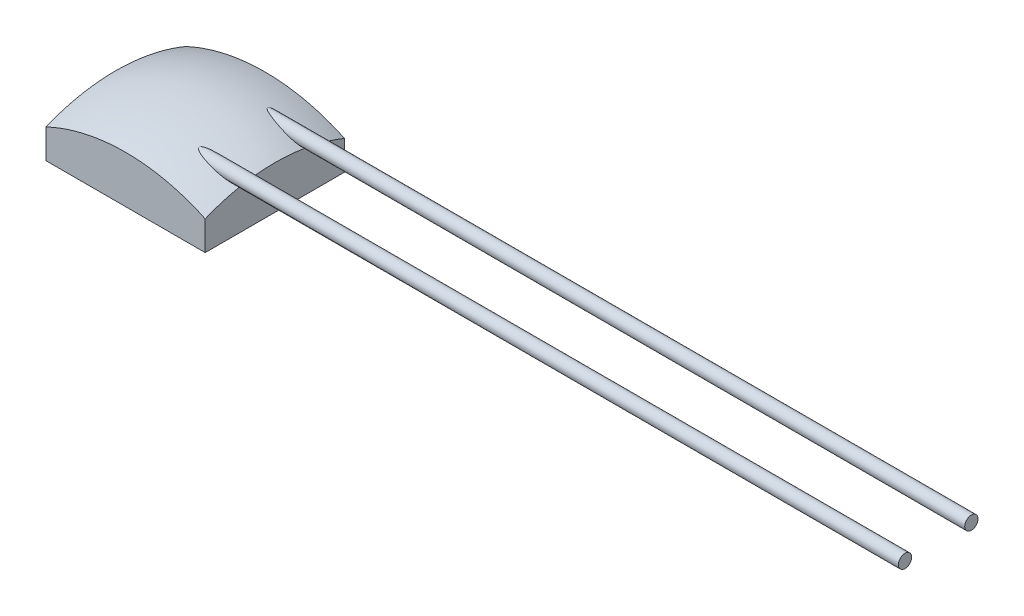
ISO-10303-21;
HEADER;
FILE_DESCRIPTION(('STEP AP214'),'2;1');
FILE_NAME('part.step','',(''),(''),'','','');
FILE_SCHEMA(('AUTOMOTIVE_DESIGN { 1 0 10303 214 1 1 1 1 }'));
ENDSEC;
DATA;
#1=APPLICATION_CONTEXT('core data for automotive mechanical design processes');
#2=APPLICATION_PROTOCOL_DEFINITION('international standard','automotive_design',2000,#1);
#3=PRODUCT_CONTEXT('',#1,'mechanical');
#4=PRODUCT('Part','Part','',(#3));
#5=PRODUCT_RELATED_PRODUCT_CATEGORY('part','',(#4));
#6=PRODUCT_DEFINITION_FORMATION('','',#4);
#7=PRODUCT_DEFINITION_CONTEXT('part definition',#1,'design');
#8=PRODUCT_DEFINITION('design','',#6,#7);
#9=PRODUCT_DEFINITION_SHAPE('','',#8);
#10=(LENGTH_UNIT() NAMED_UNIT(*) SI_UNIT(.MILLI.,.METRE.));
#11=(NAMED_UNIT(*) PLANE_ANGLE_UNIT() SI_UNIT($,.RADIAN.));
#12=(NAMED_UNIT(*) SI_UNIT($,.STERADIAN.) SOLID_ANGLE_UNIT());
#13=UNCERTAINTY_MEASURE_WITH_UNIT(LENGTH_MEASURE(1.E-05),#10,'distance_accuracy_value','');
#14=(GEOMETRIC_REPRESENTATION_CONTEXT(3) GLOBAL_UNCERTAINTY_ASSIGNED_CONTEXT((#13)) GLOBAL_UNIT_ASSIGNED_CONTEXT((#10,
#11,#12)) REPRESENTATION_CONTEXT('',''));
#15=CARTESIAN_POINT('',(0.,0.,0.));
#16=DIRECTION('',(0.,0.,1.));
#17=DIRECTION('',(1.,0.,0.));
#18=AXIS2_PLACEMENT_3D('',#15,#16,#17);
#19=CARTESIAN_POINT('',(0.,-2.1,0.));
#20=DIRECTION('',(0.,-1.,0.));
#21=DIRECTION('',(1.,0.,0.));
#22=AXIS2_PLACEMENT_3D('',#19,#20,#21);
#23=SPHERICAL_SURFACE('',#22,3.);
#24=CARTESIAN_POINT('',(0.576240865673341,0.799279968676473,-0.511978640139787));
#25=CARTESIAN_POINT('',(0.576698440532516,0.799476045551816,-0.51035326129361));
#26=CARTESIAN_POINT('',(0.577340743051578,0.79962578146369,-0.508773889246992));
#27=CARTESIAN_POINT('',(0.578891476645949,0.799846563634191,-0.505744505300956));
#28=CARTESIAN_POINT('',(0.579801176854642,0.799917226724269,-0.504295154342088));
#29=CARTESIAN_POINT('',(0.582428272725836,0.800023685064696,-0.500647271377808));
#30=CARTESIAN_POINT('',(0.584292470417058,0.800009108669073,-0.498555127833212));
#31=CARTESIAN_POINT('',(0.588273628419364,0.799875026727414,-0.494638086313737));
#32=CARTESIAN_POINT('',(0.590391150843662,0.799755283948023,-0.492813803442786));
#33=CARTESIAN_POINT('',(0.599684406913788,0.799102143178642,-0.485456063949785));
#34=CARTESIAN_POINT('',(0.607519733058122,0.798244258707961,-0.480813833260897));
#35=CARTESIAN_POINT('',(0.623602737001412,0.796209574871628,-0.472413447747457));
#36=CARTESIAN_POINT('',(0.631852847862261,0.795030655212648,-0.468661492605417));
#37=CARTESIAN_POINT('',(0.657710345667869,0.791042005778335,-0.457885318011154));
#38=CARTESIAN_POINT('',(0.675652452145567,0.787862213510135,-0.451787669890338));
#39=CARTESIAN_POINT('',(0.711797890256333,0.780865198779468,-0.440829605466151));
#40=CARTESIAN_POINT('',(0.730001797096632,0.777046275803305,-0.4359725795323));
#41=CARTESIAN_POINT('',(0.766597514572408,0.768831436602,-0.427207480169605));
#42=CARTESIAN_POINT('',(0.78498979276462,0.764433172443225,-0.423303463359898));
#43=CARTESIAN_POINT('',(0.821771698668982,0.755119233923595,-0.416361815379837));
#44=CARTESIAN_POINT('',(0.840161287661465,0.750204358723886,-0.413322872240811));
#45=CARTESIAN_POINT('',(0.88139975731868,0.738604630319943,-0.407470493043484));
#46=CARTESIAN_POINT('',(0.90424390202261,0.731780231076851,-0.40489223465871));
#47=CARTESIAN_POINT('',(0.949797793351985,0.717351207061645,-0.401236411176971));
#48=CARTESIAN_POINT('',(0.972507585454441,0.709746864416666,-0.400158305474454));
#49=CARTESIAN_POINT('',(1.01750789343149,0.693804505924328,-0.39987324490482));
#50=CARTESIAN_POINT('',(1.03980029827966,0.68547267908922,-0.400651752575037));
#51=CARTESIAN_POINT('',(1.07278449445769,0.672406048192698,-0.40378050197204));
#52=CARTESIAN_POINT('',(1.0836854938973,0.667963655190643,-0.405146305200815));
#53=CARTESIAN_POINT('',(1.10526802137715,0.658890931417101,-0.40870926552093));
#54=CARTESIAN_POINT('',(1.11594976137856,0.654260796406546,-0.410905575570886));
#55=CARTESIAN_POINT('',(1.13538066884751,0.645532880344801,-0.416006661227098));
#56=CARTESIAN_POINT('',(1.14418052806651,0.641458650929756,-0.418756988575102));
#57=CARTESIAN_POINT('',(1.16129670660003,0.633231265520665,-0.425366845174073));
#58=CARTESIAN_POINT('',(1.16961521035036,0.629078602008889,-0.429220797753165));
#59=CARTESIAN_POINT('',(1.1804655494535,0.623354276289152,-0.43572649310771));
#60=CARTESIAN_POINT('',(1.18341342752961,0.621763945131125,-0.437662727476359));
#61=CARTESIAN_POINT('',(1.18910653436953,0.618604714867435,-0.44184729161193));
#62=CARTESIAN_POINT('',(1.19185135866388,0.617035863355646,-0.444096219891286));
#63=CARTESIAN_POINT('',(1.1970648846046,0.613937481067819,-0.448992643127698));
#64=CARTESIAN_POINT('',(1.19952996935212,0.612408627456558,-0.451644504152009));
#65=CARTESIAN_POINT('',(1.20397314101834,0.60947573751877,-0.457389451381199));
#66=CARTESIAN_POINT('',(1.2059530735037,0.608071241577013,-0.460480792494528));
#67=CARTESIAN_POINT('',(1.208552115273,0.605996265022646,-0.465823697844601));
#68=CARTESIAN_POINT('',(1.20940099442364,0.605252752186916,-0.467934281357122));
#69=CARTESIAN_POINT('',(1.2107596461677,0.603886125928035,-0.472299238089109));
#70=CARTESIAN_POINT('',(1.21126980122574,0.603262877276843,-0.474553445973405));
#71=CARTESIAN_POINT('',(1.21190248785893,0.602165217511361,-0.47916725197804));
#72=CARTESIAN_POINT('',(1.21202262642784,0.601691741278888,-0.481527410981106));
#73=CARTESIAN_POINT('',(1.21185437546716,0.600919125480308,-0.486261875273666));
#74=CARTESIAN_POINT('',(1.21156588785666,0.600620027793911,-0.488636183823192));
#75=CARTESIAN_POINT('',(1.21064734872417,0.600210686589513,-0.493153335424051));
#76=CARTESIAN_POINT('',(1.21004326478269,0.600088442003945,-0.495300570096161));
#77=CARTESIAN_POINT('',(1.20856001756832,0.599979155486512,-0.499499965258608));
#78=CARTESIAN_POINT('',(1.20768073470813,0.599992172411685,-0.501552083970498));
#79=CARTESIAN_POINT('',(1.20506653911228,0.600178854470726,-0.506815646092357));
#80=CARTESIAN_POINT('',(1.20314390402794,0.600449856300566,-0.509929999464067));
#81=CARTESIAN_POINT('',(1.19889484490478,0.601217227484595,-0.515839255839478));
#82=CARTESIAN_POINT('',(1.19656713773197,0.601714321351088,-0.518633095433995));
#83=CARTESIAN_POINT('',(1.1896080376026,0.603344548818494,-0.526123195879892));
#84=CARTESIAN_POINT('',(1.18466267799143,0.604663807212367,-0.530483386708567));
#85=CARTESIAN_POINT('',(1.174304762979,0.607600192242984,-0.538474523675965));
#86=CARTESIAN_POINT('',(1.16889099839719,0.60921810281884,-0.542103496730261));
#87=CARTESIAN_POINT('',(1.15558183980314,0.613313974107379,-0.55013223116531));
#88=CARTESIAN_POINT('',(1.14755429945624,0.615878423597452,-0.554266266124833));
#89=CARTESIAN_POINT('',(1.13119352881307,0.621201797027503,-0.561738667034829));
#90=CARTESIAN_POINT('',(1.12285972286917,0.623961097220112,-0.565075435859581));
#91=CARTESIAN_POINT('',(1.09751041307879,0.632423863559681,-0.5741825710018));
#92=CARTESIAN_POINT('',(1.08021482644777,0.638290330542896,-0.579013841316598));
#93=CARTESIAN_POINT('',(1.03953640220033,0.652076578198062,-0.588275772690635));
#94=CARTESIAN_POINT('',(1.01602768127254,0.660035292060854,-0.592048498085154));
#95=CARTESIAN_POINT('',(0.968697489082186,0.675855160315568,-0.597397969818157));
#96=CARTESIAN_POINT('',(0.944875509093151,0.683716100975287,-0.598970536434315));
#97=CARTESIAN_POINT('',(0.897157523946612,0.699175020614801,-0.600296336473199));
#98=CARTESIAN_POINT('',(0.87326178304995,0.706773522086761,-0.600053422527118));
#99=CARTESIAN_POINT('',(0.825447558923165,0.721659457940977,-0.597915175086452));
#100=CARTESIAN_POINT('',(0.801529073751808,0.728946862765569,-0.596019684943531));
#101=CARTESIAN_POINT('',(0.754475476681414,0.742983078258327,-0.590597835185693));
#102=CARTESIAN_POINT('',(0.731337832413607,0.74974139273054,-0.58712056581184));
#103=CARTESIAN_POINT('',(0.692755226672634,0.76085666665064,-0.579536772768961));
#104=CARTESIAN_POINT('',(0.677223090550502,0.765288604943006,-0.575989761644213));
#105=CARTESIAN_POINT('',(0.651307852816891,0.772698707504365,-0.568795952535851));
#106=CARTESIAN_POINT('',(0.640833901473795,0.775697961601157,-0.565527443620137));
#107=CARTESIAN_POINT('',(0.623417572491995,0.78077870703001,-0.559041785623963));
#108=CARTESIAN_POINT('',(0.616366050996216,0.782863139293648,-0.556108686848767));
#109=CARTESIAN_POINT('',(0.60223743697839,0.787173320702457,-0.549189864395355));
#110=CARTESIAN_POINT('',(0.595179536154272,0.789400621582098,-0.545155841595693));
#111=CARTESIAN_POINT('',(0.587529957550349,0.79212360102504,-0.538918582120713));
#112=CARTESIAN_POINT('',(0.586158272880458,0.792626529721846,-0.537711666687716));
#113=CARTESIAN_POINT('',(0.583551123865027,0.793627998473187,-0.535152938988275));
#114=CARTESIAN_POINT('',(0.582315703942393,0.79412653704807,-0.533801079751097));
#115=CARTESIAN_POINT('',(0.580233070359693,0.795031145407197,-0.531156086209905));
#116=CARTESIAN_POINT('',(0.579355369221606,0.79543925949563,-0.529888097209732));
#117=CARTESIAN_POINT('',(0.577815175636398,0.796233812460191,-0.527220864903687));
#118=CARTESIAN_POINT('',(0.57715212036088,0.796620305788149,-0.525821977467186));
#119=CARTESIAN_POINT('',(0.576260608324526,0.797255223613249,-0.523294604716208));
#120=CARTESIAN_POINT('',(0.575963491864414,0.797513050994201,-0.522193008542625));
#121=CARTESIAN_POINT('',(0.575560261655642,0.7979967479926,-0.519948639717626));
#122=CARTESIAN_POINT('',(0.575453915620594,0.798222656166248,-0.518805918873196));
#123=CARTESIAN_POINT('',(0.575445117592252,0.798599634134411,-0.51670496352834));
#124=CARTESIAN_POINT('',(0.575511525456848,0.798756901356881,-0.515747854544333));
#125=CARTESIAN_POINT('',(0.575778850940734,0.799041133813636,-0.51384838310943));
#126=CARTESIAN_POINT('',(0.575979789868596,0.799168094243262,-0.512906023018835));
#127=CARTESIAN_POINT('',(0.576240865673341,0.799279968676473,-0.511978640139787));
#128=B_SPLINE_CURVE_WITH_KNOTS('',3,(#24,#25,#26,#27,#28,#29,#30,#31,#32,#33,#34,#35,#36,#37,
#38,#39,#40,#41,#42,#43,#44,#45,#46,#47,#48,#49,#50,#51,#52,#53,#54,#55,#56,#57,#58,#59,#60,#61,
#62,#63,#64,#65,#66,#67,#68,#69,#70,#71,#72,#73,#74,#75,#76,#77,#78,#79,#80,#81,#82,#83,#84,#85,
#86,#87,#88,#89,#90,#91,#92,#93,#94,#95,#96,#97,#98,#99,#100,#101,#102,#103,#104,#105,#106,#107,
#108,#109,#110,#111,#112,#113,#114,#115,#116,#117,#118,#119,#120,#121,#122,#123,#124,#125,#126,
#127),.UNSPECIFIED.,.T.,.F.,(4,2,2,2,2,2,2,2,2,2,2,2,2,2,2,2,2,2,2,2,2,2,2,2,2,2,2,2,2,2,2,2,2,
2,2,2,2,2,2,2,2,2,2,2,2,2,2,2,2,2,2,4),(0.,0.00509471985115773,0.0102140220451698,
0.0185732816974082,0.0269514466627636,0.0541831537999721,0.0815992691155205,0.139096990725946,
0.196750200254489,0.254644699292778,0.312450922103352,0.384335702786485,0.456194571850682,
0.527492628693761,0.563022059747608,0.598515351327128,0.628716845851685,0.658768345166241,
0.67036192196478,0.681978003037514,0.693730351379271,0.705437273277011,0.7125911817269,
0.719736998661652,0.726926577803773,0.734117882924194,0.740793677291624,0.747472376653427,
0.758418652423879,0.769400255418687,0.789457923115105,0.809569009317905,0.837662010228026,
0.865810825342058,0.922345388720209,0.997530202736491,1.0728576550496,1.14802530043972,
1.22320007177474,1.29618609936994,1.34576349706187,1.37983260264031,1.40358700488281,
1.42862447712984,1.4343018852723,1.43998113883808,1.44475271965728,1.44951168549554,
1.45300641105738,1.45649687846647,1.45940328244426,1.46231014688058),.UNSPECIFIED.);
#129=CARTESIAN_POINT('',(1.2,0.601023317731769,-0.514269420702096));
#130=VERTEX_POINT('',#129);
#131=CARTESIAN_POINT('',(1.2,0.612079278065512,-0.452356042833133));
#132=VERTEX_POINT('',#131);
#133=EDGE_CURVE('E98',#130,#132,#128,.T.);
#134=ORIENTED_EDGE('',*,*,#133,.F.);
#135=CARTESIAN_POINT('',(1.2,-2.1,0.));
#136=DIRECTION('',(1.,0.,0.));
#137=DIRECTION('',(0.,0.,-1.));
#138=AXIS2_PLACEMENT_3D('',#135,#136,#137);
#139=CIRCLE('',#138,2.7495454169735);
#140=CARTESIAN_POINT('',(1.2,0.441161151914612,-1.05));
#141=VERTEX_POINT('',#140);
#142=EDGE_CURVE('E86',#130,#141,#139,.F.);
#143=ORIENTED_EDGE('',*,*,#142,.T.);
#144=CARTESIAN_POINT('',(0.,-2.1,-1.05));
#145=DIRECTION('',(0.,0.,-1.));
#146=DIRECTION('',(-1.,0.,0.));
#147=AXIS2_PLACEMENT_3D('',#144,#145,#146);
#148=CIRCLE('',#147,2.81024909927928);
#149=CARTESIAN_POINT('',(-1.2,0.441161151914612,-1.05));
#150=VERTEX_POINT('',#149);
#151=EDGE_CURVE('E95',#141,#150,#148,.F.);
#152=ORIENTED_EDGE('',*,*,#151,.T.);
#153=CARTESIAN_POINT('',(-1.2,-2.1,0.));
#154=DIRECTION('',(-1.,0.,0.));
#155=DIRECTION('',(0.,0.,1.));
#156=AXIS2_PLACEMENT_3D('',#153,#154,#155);
#157=CIRCLE('',#156,2.7495454169735);
#158=CARTESIAN_POINT('',(-1.2,0.441161151914612,1.05));
#159=VERTEX_POINT('',#158);
#160=EDGE_CURVE('E181',#150,#159,#157,.F.);
#161=ORIENTED_EDGE('',*,*,#160,.T.);
#162=CARTESIAN_POINT('',(0.,-2.1,1.05));
#163=DIRECTION('',(0.,0.,1.));
#164=DIRECTION('',(1.,0.,0.));
#165=AXIS2_PLACEMENT_3D('',#162,#163,#164);
#166=CIRCLE('',#165,2.81024909927928);
#167=CARTESIAN_POINT('',(1.2,0.441161151914612,1.05));
#168=VERTEX_POINT('',#167);
#169=EDGE_CURVE('E172',#159,#168,#166,.F.);
#170=ORIENTED_EDGE('',*,*,#169,.T.);
#171=CARTESIAN_POINT('',(1.2,0.601023317731768,0.514269420702096));
#172=VERTEX_POINT('',#171);
#173=EDGE_CURVE('E191',#168,#172,#139,.F.);
#174=ORIENTED_EDGE('',*,*,#173,.T.);
#175=CARTESIAN_POINT('',(1.2002,0.611951222332437,0.452593114938355));
#176=CARTESIAN_POINT('',(1.19591582693882,0.614681281546974,0.447594619139513));
#177=CARTESIAN_POINT('',(1.19107973116606,0.617514171643169,0.443278358546464));
#178=CARTESIAN_POINT('',(1.18077133359095,0.623225243986398,0.435742208305545));
#179=CARTESIAN_POINT('',(1.17531104019783,0.626101873642248,0.43250517123114));
#180=CARTESIAN_POINT('',(1.15648407794038,0.635696050513195,0.422820835792717));
#181=CARTESIAN_POINT('',(1.14235868713552,0.642377147232193,0.417909627456812));
#182=CARTESIAN_POINT('',(1.11322984910015,0.655502011689797,0.410127352517914));
#183=CARTESIAN_POINT('',(1.09821533040531,0.661939541389821,0.40729367394247));
#184=CARTESIAN_POINT('',(1.06230255804365,0.676716146529162,0.402330539785429));
#185=CARTESIAN_POINT('',(1.04125224281241,0.684894297359709,0.400833011865198));
#186=CARTESIAN_POINT('',(0.99883346914428,0.70055121254838,0.399697280239385));
#187=CARTESIAN_POINT('',(0.977464529731629,0.708028761459538,0.400062249032603));
#188=CARTESIAN_POINT('',(0.934683739352722,0.722246202385566,0.402242459650218));
#189=CARTESIAN_POINT('',(0.913272698149582,0.728989749875082,0.404050102017371));
#190=CARTESIAN_POINT('',(0.87039249582961,0.741783206938719,0.408890579020935));
#191=CARTESIAN_POINT('',(0.84892335489941,0.747833331972211,0.41192303175362));
#192=CARTESIAN_POINT('',(0.80495044450103,0.759507022288469,0.419322265428411));
#193=CARTESIAN_POINT('',(0.782447135197758,0.765095533977506,0.423746765618688));
#194=CARTESIAN_POINT('',(0.73756731368784,0.775452251338203,0.433963675367724));
#195=CARTESIAN_POINT('',(0.715190718193325,0.780221076513134,0.439755043947399));
#196=CARTESIAN_POINT('',(0.681915092873955,0.786643215895529,0.449913468950106));
#197=CARTESIAN_POINT('',(0.670864552248557,0.788663121917631,0.45354759600655));
#198=CARTESIAN_POINT('',(0.648986326171087,0.792398866729101,0.461502098236827));
#199=CARTESIAN_POINT('',(0.638158144740964,0.794115466967798,0.465820701736728));
#200=CARTESIAN_POINT('',(0.620064087606322,0.796677944151662,0.474179654191741));
#201=CARTESIAN_POINT('',(0.612687360519846,0.797631411852361,0.477928106645923));
#202=CARTESIAN_POINT('',(0.601878093364666,0.798807115742772,0.484436983594046));
#203=CARTESIAN_POINT('',(0.598235854442311,0.799161594009754,0.48682146739409));
#204=CARTESIAN_POINT('',(0.59125908403352,0.799715687647671,0.49201665285894));
#205=CARTESIAN_POINT('',(0.587922920508097,0.79991617220498,0.494824853667324));
#206=CARTESIAN_POINT('',(0.583882071510973,0.80000158516025,0.499074010723441));
#207=CARTESIAN_POINT('',(0.582874345206506,0.800006851937351,0.500220037480568));
#208=CARTESIAN_POINT('',(0.580981152662644,0.799973089204631,0.502612482146851));
#209=CARTESIAN_POINT('',(0.580095828344914,0.799934008750718,0.503859013982263));
#210=CARTESIAN_POINT('',(0.578490016728427,0.799798725394533,0.506477094699964));
#211=CARTESIAN_POINT('',(0.577771880803778,0.79970176895127,0.507850086997858));
#212=CARTESIAN_POINT('',(0.57659354822237,0.799436493502476,0.510695871372723));
#213=CARTESIAN_POINT('',(0.57613247524848,0.799268420420962,0.512168304968555));
#214=CARTESIAN_POINT('',(0.575617115923675,0.798908397429385,0.514777957817619));
#215=CARTESIAN_POINT('',(0.575488242384795,0.798734011373147,0.515902818962532));
#216=CARTESIAN_POINT('',(0.575425184015901,0.79834546353903,0.518151264047677));
#217=CARTESIAN_POINT('',(0.575490957237741,0.798131310340654,0.519274848210903));
#218=CARTESIAN_POINT('',(0.57580893609136,0.797671486437685,0.521483767649792));
#219=CARTESIAN_POINT('',(0.576060506746925,0.797425925429218,0.522569220039655));
#220=CARTESIAN_POINT('',(0.576723721983538,0.7969117814721,0.524683882309739));
#221=CARTESIAN_POINT('',(0.577135505995732,0.796643178629663,0.525713042307303));
#222=CARTESIAN_POINT('',(0.578381648037879,0.795920387684795,0.528321077805155));
#223=CARTESIAN_POINT('',(0.57931987784968,0.795454108611809,0.529846543330691));
#224=CARTESIAN_POINT('',(0.581418397068878,0.794504246670102,0.532729995751978));
#225=CARTESIAN_POINT('',(0.582579413389276,0.794020611491196,0.534087409790656));
#226=CARTESIAN_POINT('',(0.5868598550676,0.792328560563707,0.538564643352374));
#227=CARTESIAN_POINT('',(0.590339207408978,0.791104637461792,0.541326523168721));
#228=CARTESIAN_POINT('',(0.597648612216824,0.788659503706457,0.546336759331222));
#229=CARTESIAN_POINT('',(0.601480771466175,0.787438360834072,0.548581707363833));
#230=CARTESIAN_POINT('',(0.612398161878051,0.784045955988772,0.554359601695429));
#231=CARTESIAN_POINT('',(0.619679345724801,0.78188003198209,0.557523281165877));
#232=CARTESIAN_POINT('',(0.634480981422526,0.777544520337372,0.563240164767758));
#233=CARTESIAN_POINT('',(0.642002026893475,0.775374938624311,0.565791695429973));
#234=CARTESIAN_POINT('',(0.66478868881969,0.768831903779407,0.572827582439743));
#235=CARTESIAN_POINT('',(0.680242087929022,0.764434618747971,0.576677723168173));
#236=CARTESIAN_POINT('',(0.722556015493366,0.752296300568486,0.585771407332125));
#237=CARTESIAN_POINT('',(0.749586076878414,0.744436293341578,0.590009845844015));
#238=CARTESIAN_POINT('',(0.803818556504477,0.728269119806225,0.596306867643608));
#239=CARTESIAN_POINT('',(0.831021222566619,0.719961011928319,0.5983606567819));
#240=CARTESIAN_POINT('',(0.885225441149411,0.702998072084011,0.600317178626691));
#241=CARTESIAN_POINT('',(0.912227251578661,0.69434550492283,0.600232194948558));
#242=CARTESIAN_POINT('',(0.965993893549538,0.676768716777772,0.59767083670798));
#243=CARTESIAN_POINT('',(0.992759086211614,0.667845062342488,0.59519915638676));
#244=CARTESIAN_POINT('',(1.0338453007167,0.654003944069739,0.588954641714437));
#245=CARTESIAN_POINT('',(1.04833493225246,0.649094645607504,0.586271262748397));
#246=CARTESIAN_POINT('',(1.0771534910634,0.639327878413646,0.579712082653121));
#247=CARTESIAN_POINT('',(1.0914813442902,0.634470761286769,0.575830741675081));
#248=CARTESIAN_POINT('',(1.1176441894496,0.625689182325612,0.567157796288467));
#249=CARTESIAN_POINT('',(1.12953850933134,0.621731862488429,0.562580876095718));
#250=CARTESIAN_POINT('',(1.15261940025835,0.614240417648816,0.551852023321529));
#251=CARTESIAN_POINT('',(1.16381264727462,0.610701864859286,0.545719237217129));
#252=CARTESIAN_POINT('',(1.17905910443346,0.60623234847568,0.534941319846124));
#253=CARTESIAN_POINT('',(1.18368463372192,0.604929887700076,0.53130117446594));
#254=CARTESIAN_POINT('',(1.19242247800014,0.602657816552046,0.523265192939721));
#255=CARTESIAN_POINT('',(1.19652732609991,0.60169276110126,0.518860134029706));
#256=CARTESIAN_POINT('',(1.20020000000007,0.60098522859458,0.51400267987018));
#257=B_SPLINE_CURVE_WITH_KNOTS('',3,(#175,#176,#177,#178,#179,#180,#181,#182,#183,#184,#185,
#186,#187,#188,#189,#190,#191,#192,#193,#194,#195,#196,#197,#198,#199,#200,#201,#202,#203,#204,
#205,#206,#207,#208,#209,#210,#211,#212,#213,#214,#215,#216,#217,#218,#219,#220,#221,#222,#223,
#224,#225,#226,#227,#228,#229,#230,#231,#232,#233,#234,#235,#236,#237,#238,#239,#240,#241,#242,
#243,#244,#245,#246,#247,#248,#249,#250,#251,#252,#253,#254,#255,#256),.UNSPECIFIED.,.F.,.F.,(4,
2,2,2,2,2,2,2,2,2,2,2,2,2,2,2,2,2,2,2,2,2,2,2,2,2,2,2,2,2,2,2,2,2,2,2,2,2,2,2,4),(0.,
0.0211725270541012,0.0419905434310988,0.0908012560628805,0.140470160185068,0.208221047714887,
0.276087377745721,0.343598554680875,0.411088697428723,0.481861031577078,0.552579639896058,
0.587983622539557,0.623297419954564,0.648222395467823,0.661312761530353,0.67432868740153,
0.678900397018955,0.683477363730767,0.688115263298263,0.692737254242634,0.696157771045187,
0.69957755074896,0.702985696875999,0.706396815717198,0.711916351880569,0.717454213330773,
0.731170940490474,0.744975670524122,0.769598276996059,0.794287447784537,0.843786111242905,
0.929071773152212,1.01454420827514,1.09952586212503,1.18434071072325,1.23090664105149,
1.27769122142338,1.31766699568078,1.35717286023636,1.37519242746529,1.39344662988426),.UNSPECIFIED.);
#258=CARTESIAN_POINT('',(1.2,0.612079278065512,0.452356042833133));
#259=VERTEX_POINT('',#258);
#260=EDGE_CURVE('E150',#259,#172,#257,.T.);
#261=ORIENTED_EDGE('',*,*,#260,.F.);
#262=EDGE_CURVE('E94',#259,#132,#139,.F.);
#263=ORIENTED_EDGE('',*,*,#262,.T.);
#264=EDGE_LOOP('',(#134,#143,#152,#161,#170,#174,#261,#263));
#265=FACE_BOUND('',#264,.T.);
#266=ADVANCED_FACE('F34',(#265),#23,.T.);
#267=CARTESIAN_POINT('',(1.2,0.9,-1.05));
#268=DIRECTION('',(1.,0.,0.));
#269=DIRECTION('',(0.,0.,-1.));
#270=AXIS2_PLACEMENT_3D('',#267,#268,#269);
#271=PLANE('',#270);
#272=CARTESIAN_POINT('',(1.2,0.7,-0.5));
#273=DIRECTION('',(1.,0.,0.));
#274=DIRECTION('',(0.,-0.879207219344887,0.476439571668676));
#275=AXIS2_PLACEMENT_3D('',#272,#273,#274);
#276=CIRCLE('',#275,0.1);
#277=EDGE_CURVE('E12',#132,#130,#276,.T.);
#278=ORIENTED_EDGE('',*,*,#277,.F.);
#279=ORIENTED_EDGE('',*,*,#262,.F.);
#280=CARTESIAN_POINT('',(1.2,0.7,0.5));
#281=DIRECTION('',(1.,0.,0.));
#282=DIRECTION('',(0.,-0.989766822682322,0.142694207020958));
#283=AXIS2_PLACEMENT_3D('',#280,#281,#282);
#284=CIRCLE('',#283,0.1);
#285=EDGE_CURVE('E45',#172,#259,#284,.T.);
#286=ORIENTED_EDGE('',*,*,#285,.F.);
#287=ORIENTED_EDGE('',*,*,#173,.F.);
#288=DIRECTION('',(0.,-1.,0.));
#289=VECTOR('',#288,1.);
#290=CARTESIAN_POINT('',(1.2,0.9,1.05));
#291=LINE('',#290,#289);
#292=CARTESIAN_POINT('',(1.2,0.,1.05));
#293=VERTEX_POINT('',#292);
#294=EDGE_CURVE('E170',#168,#293,#291,.T.);
#295=ORIENTED_EDGE('',*,*,#294,.T.);
#296=DIRECTION('',(0.,0.,1.));
#297=VECTOR('',#296,1.);
#298=CARTESIAN_POINT('',(1.2,0.,-1.05));
#299=LINE('',#298,#297);
#300=CARTESIAN_POINT('',(1.2,0.,-1.05));
#301=VERTEX_POINT('',#300);
#302=EDGE_CURVE('E158',#301,#293,#299,.T.);
#303=ORIENTED_EDGE('',*,*,#302,.F.);
#304=DIRECTION('',(0.,-1.,0.));
#305=VECTOR('',#304,1.);
#306=CARTESIAN_POINT('',(1.2,0.9,-1.05));
#307=LINE('',#306,#305);
#308=EDGE_CURVE('E90',#141,#301,#307,.T.);
#309=ORIENTED_EDGE('',*,*,#308,.F.);
#310=ORIENTED_EDGE('',*,*,#142,.F.);
#311=EDGE_LOOP('',(#278,#279,#286,#287,#295,#303,#309,#310));
#312=FACE_BOUND('',#311,.T.);
#313=ADVANCED_FACE('F88',(#312),#271,.T.);
#314=CARTESIAN_POINT('',(-1.2,0.9,-1.05));
#315=DIRECTION('',(0.,0.,-1.));
#316=DIRECTION('',(-1.,0.,0.));
#317=AXIS2_PLACEMENT_3D('',#314,#315,#316);
#318=PLANE('',#317);
#319=ORIENTED_EDGE('',*,*,#308,.T.);
#320=DIRECTION('',(1.,0.,0.));
#321=VECTOR('',#320,1.);
#322=CARTESIAN_POINT('',(-1.2,0.,-1.05));
#323=LINE('',#322,#321);
#324=CARTESIAN_POINT('',(-1.2,0.,-1.05));
#325=VERTEX_POINT('',#324);
#326=EDGE_CURVE('E167',#325,#301,#323,.T.);
#327=ORIENTED_EDGE('',*,*,#326,.F.);
#328=DIRECTION('',(0.,-1.,0.));
#329=VECTOR('',#328,1.);
#330=CARTESIAN_POINT('',(-1.2,0.9,-1.05));
#331=LINE('',#330,#329);
#332=EDGE_CURVE('E173',#150,#325,#331,.T.);
#333=ORIENTED_EDGE('',*,*,#332,.F.);
#334=ORIENTED_EDGE('',*,*,#151,.F.);
#335=EDGE_LOOP('',(#319,#327,#333,#334));
#336=FACE_BOUND('',#335,.T.);
#337=ADVANCED_FACE('F137',(#336),#318,.T.);
#338=CARTESIAN_POINT('',(-1.2,0.9,-1.05));
#339=DIRECTION('',(-1.,0.,0.));
#340=DIRECTION('',(0.,0.,1.));
#341=AXIS2_PLACEMENT_3D('',#338,#339,#340);
#342=PLANE('',#341);
#343=ORIENTED_EDGE('',*,*,#332,.T.);
#344=DIRECTION('',(0.,0.,-1.));
#345=VECTOR('',#344,1.);
#346=CARTESIAN_POINT('',(-1.2,0.,-1.05));
#347=LINE('',#346,#345);
#348=CARTESIAN_POINT('',(-1.2,0.,1.05));
#349=VERTEX_POINT('',#348);
#350=EDGE_CURVE('E164',#349,#325,#347,.T.);
#351=ORIENTED_EDGE('',*,*,#350,.F.);
#352=DIRECTION('',(0.,-1.,0.));
#353=VECTOR('',#352,1.);
#354=CARTESIAN_POINT('',(-1.2,0.9,1.05));
#355=LINE('',#354,#353);
#356=EDGE_CURVE('E175',#159,#349,#355,.T.);
#357=ORIENTED_EDGE('',*,*,#356,.F.);
#358=ORIENTED_EDGE('',*,*,#160,.F.);
#359=EDGE_LOOP('',(#343,#351,#357,#358));
#360=FACE_BOUND('',#359,.T.);
#361=ADVANCED_FACE('F220',(#360),#342,.T.);
#362=CARTESIAN_POINT('',(-1.2,0.9,1.05));
#363=DIRECTION('',(0.,0.,1.));
#364=DIRECTION('',(1.,0.,0.));
#365=AXIS2_PLACEMENT_3D('',#362,#363,#364);
#366=PLANE('',#365);
#367=ORIENTED_EDGE('',*,*,#356,.T.);
#368=DIRECTION('',(-1.,0.,0.));
#369=VECTOR('',#368,1.);
#370=CARTESIAN_POINT('',(-1.2,0.,1.05));
#371=LINE('',#370,#369);
#372=EDGE_CURVE('E161',#293,#349,#371,.T.);
#373=ORIENTED_EDGE('',*,*,#372,.F.);
#374=ORIENTED_EDGE('',*,*,#294,.F.);
#375=ORIENTED_EDGE('',*,*,#169,.F.);
#376=EDGE_LOOP('',(#367,#373,#374,#375));
#377=FACE_BOUND('',#376,.T.);
#378=ADVANCED_FACE('F202',(#377),#366,.T.);
#379=CARTESIAN_POINT('',(0.,0.,0.));
#380=DIRECTION('',(0.,-1.,0.));
#381=DIRECTION('',(0.,0.,-1.));
#382=AXIS2_PLACEMENT_3D('',#379,#380,#381);
#383=PLANE('',#382);
#384=ORIENTED_EDGE('',*,*,#326,.T.);
#385=ORIENTED_EDGE('',*,*,#302,.T.);
#386=ORIENTED_EDGE('',*,*,#372,.T.);
#387=ORIENTED_EDGE('',*,*,#350,.T.);
#388=EDGE_LOOP('',(#384,#385,#386,#387));
#389=FACE_BOUND('',#388,.T.);
#390=ADVANCED_FACE('F36',(#389),#383,.T.);
#391=CARTESIAN_POINT('',(0.2,0.7,0.5));
#392=DIRECTION('',(1.,0.,0.));
#393=DIRECTION('',(0.,0.,-1.));
#394=AXIS2_PLACEMENT_3D('',#391,#392,#393);
#395=CYLINDRICAL_SURFACE('',#394,0.1);
#396=ORIENTED_EDGE('',*,*,#285,.T.);
#397=ORIENTED_EDGE('',*,*,#260,.T.);
#398=EDGE_LOOP('',(#396,#397));
#399=FACE_BOUND('',#398,.T.);
#400=CARTESIAN_POINT('',(11.2,0.7,0.5));
#401=DIRECTION('',(1.,0.,0.));
#402=DIRECTION('',(0.,0.,-1.));
#403=AXIS2_PLACEMENT_3D('',#400,#401,#402);
#404=CIRCLE('',#403,0.1);
#405=CARTESIAN_POINT('',(11.2,0.7,0.4));
#406=VERTEX_POINT('',#405);
#407=EDGE_CURVE('E101',#406,#406,#404,.T.);
#408=ORIENTED_EDGE('',*,*,#407,.F.);
#409=EDGE_LOOP('',(#408));
#410=FACE_BOUND('',#409,.T.);
#411=ADVANCED_FACE('F131',(#399,#410),#395,.T.);
#412=CARTESIAN_POINT('',(11.2,0.7,0.5));
#413=DIRECTION('',(1.,0.,0.));
#414=DIRECTION('',(0.,0.,-1.));
#415=AXIS2_PLACEMENT_3D('',#412,#413,#414);
#416=PLANE('',#415);
#417=ORIENTED_EDGE('',*,*,#407,.T.);
#418=EDGE_LOOP('',(#417));
#419=FACE_BOUND('',#418,.T.);
#420=ADVANCED_FACE('F127',(#419),#416,.T.);
#421=CARTESIAN_POINT('',(0.2,0.7,-0.5));
#422=DIRECTION('',(1.,0.,0.));
#423=DIRECTION('',(0.,0.,-1.));
#424=AXIS2_PLACEMENT_3D('',#421,#422,#423);
#425=CYLINDRICAL_SURFACE('',#424,0.1);
#426=ORIENTED_EDGE('',*,*,#277,.T.);
#427=ORIENTED_EDGE('',*,*,#133,.T.);
#428=EDGE_LOOP('',(#426,#427));
#429=FACE_BOUND('',#428,.T.);
#430=CARTESIAN_POINT('',(11.2,0.7,-0.5));
#431=DIRECTION('',(1.,0.,0.));
#432=DIRECTION('',(0.,0.,-1.));
#433=AXIS2_PLACEMENT_3D('',#430,#431,#432);
#434=CIRCLE('',#433,0.1);
#435=CARTESIAN_POINT('',(11.2,0.7,-0.6));
#436=VERTEX_POINT('',#435);
#437=EDGE_CURVE('E102',#436,#436,#434,.T.);
#438=ORIENTED_EDGE('',*,*,#437,.F.);
#439=EDGE_LOOP('',(#438));
#440=FACE_BOUND('',#439,.T.);
#441=ADVANCED_FACE('F105',(#429,#440),#425,.T.);
#442=CARTESIAN_POINT('',(11.2,0.7,-0.5));
#443=DIRECTION('',(1.,0.,0.));
#444=DIRECTION('',(0.,0.,-1.));
#445=AXIS2_PLACEMENT_3D('',#442,#443,#444);
#446=PLANE('',#445);
#447=ORIENTED_EDGE('',*,*,#437,.T.);
#448=EDGE_LOOP('',(#447));
#449=FACE_BOUND('',#448,.T.);
#450=ADVANCED_FACE('F126',(#449),#446,.T.);
#451=CLOSED_SHELL('',(#266,#313,#337,#361,#378,#390,#411,#420,#441,#450));
#452=MANIFOLD_SOLID_BREP('B2',#451);
#453=ADVANCED_BREP_SHAPE_REPRESENTATION('',(#18,#452),#14);
#454=SHAPE_DEFINITION_REPRESENTATION(#9,#453);
ENDSEC;
END-ISO-10303-21;
